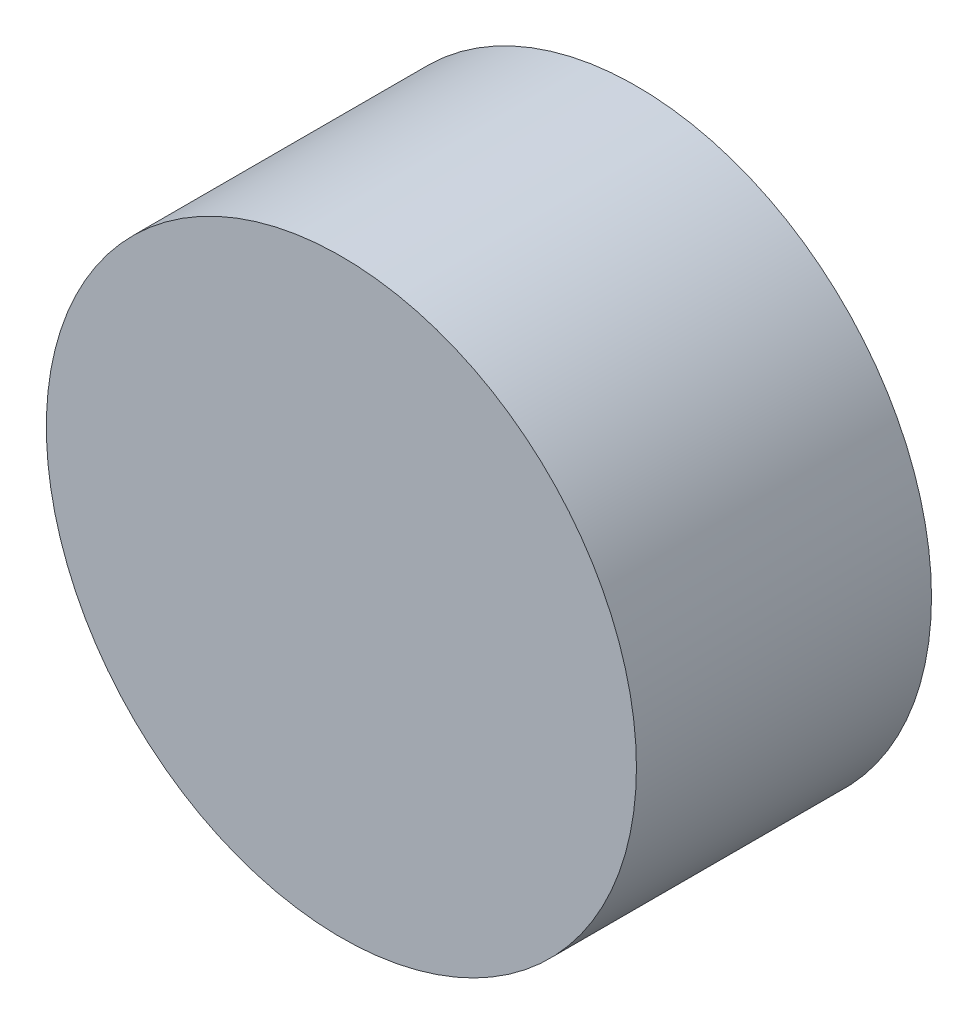
ISO-10303-21;
HEADER;
FILE_DESCRIPTION(('STEP AP214'),'2;1');
FILE_NAME('part.step','',(''),(''),'','','');
FILE_SCHEMA(('AUTOMOTIVE_DESIGN { 1 0 10303 214 1 1 1 1 }'));
ENDSEC;
DATA;
#1=APPLICATION_CONTEXT('core data for automotive mechanical design processes');
#2=APPLICATION_PROTOCOL_DEFINITION('international standard','automotive_design',2000,#1);
#3=PRODUCT_CONTEXT('',#1,'mechanical');
#4=PRODUCT('Part','Part','',(#3));
#5=PRODUCT_RELATED_PRODUCT_CATEGORY('part','',(#4));
#6=PRODUCT_DEFINITION_FORMATION('','',#4);
#7=PRODUCT_DEFINITION_CONTEXT('part definition',#1,'design');
#8=PRODUCT_DEFINITION('design','',#6,#7);
#9=PRODUCT_DEFINITION_SHAPE('','',#8);
#10=(LENGTH_UNIT() NAMED_UNIT(*) SI_UNIT(.MILLI.,.METRE.));
#11=(NAMED_UNIT(*) PLANE_ANGLE_UNIT() SI_UNIT($,.RADIAN.));
#12=(NAMED_UNIT(*) SI_UNIT($,.STERADIAN.) SOLID_ANGLE_UNIT());
#13=UNCERTAINTY_MEASURE_WITH_UNIT(LENGTH_MEASURE(1.E-05),#10,'distance_accuracy_value','');
#14=(GEOMETRIC_REPRESENTATION_CONTEXT(3) GLOBAL_UNCERTAINTY_ASSIGNED_CONTEXT((#13)) GLOBAL_UNIT_ASSIGNED_CONTEXT((#10,
#11,#12)) REPRESENTATION_CONTEXT('',''));
#15=CARTESIAN_POINT('',(0.,0.,0.));
#16=DIRECTION('',(0.,0.,1.));
#17=DIRECTION('',(1.,0.,0.));
#18=AXIS2_PLACEMENT_3D('',#15,#16,#17);
#19=CARTESIAN_POINT('',(0.,0.,1.));
#20=DIRECTION('',(0.,0.,-1.));
#21=DIRECTION('',(-1.,0.,0.));
#22=AXIS2_PLACEMENT_3D('',#19,#20,#21);
#23=CYLINDRICAL_SURFACE('',#22,2.);
#24=CARTESIAN_POINT('',(0.,0.,1.));
#25=DIRECTION('',(0.,0.,1.));
#26=DIRECTION('',(1.,0.,0.));
#27=AXIS2_PLACEMENT_3D('',#24,#25,#26);
#28=CIRCLE('',#27,2.);
#29=CARTESIAN_POINT('',(2.,0.,1.));
#30=VERTEX_POINT('',#29);
#31=EDGE_CURVE('E10',#30,#30,#28,.T.);
#32=ORIENTED_EDGE('',*,*,#31,.F.);
#33=EDGE_LOOP('',(#32));
#34=FACE_BOUND('',#33,.T.);
#35=CARTESIAN_POINT('',(0.,0.,-1.));
#36=DIRECTION('',(0.,0.,1.));
#37=DIRECTION('',(1.,0.,0.));
#38=AXIS2_PLACEMENT_3D('',#35,#36,#37);
#39=CIRCLE('',#38,2.);
#40=CARTESIAN_POINT('',(2.,0.,-1.));
#41=VERTEX_POINT('',#40);
#42=EDGE_CURVE('E40',#41,#41,#39,.T.);
#43=ORIENTED_EDGE('',*,*,#42,.T.);
#44=EDGE_LOOP('',(#43));
#45=FACE_BOUND('',#44,.T.);
#46=ADVANCED_FACE('F37',(#34,#45),#23,.T.);
#47=CARTESIAN_POINT('',(0.,0.,1.));
#48=DIRECTION('',(0.,0.,1.));
#49=DIRECTION('',(1.,0.,0.));
#50=AXIS2_PLACEMENT_3D('',#47,#48,#49);
#51=PLANE('',#50);
#52=ORIENTED_EDGE('',*,*,#31,.T.);
#53=EDGE_LOOP('',(#52));
#54=FACE_BOUND('',#53,.T.);
#55=ADVANCED_FACE('F54',(#54),#51,.T.);
#56=CARTESIAN_POINT('',(0.,0.,-1.));
#57=DIRECTION('',(0.,0.,1.));
#58=DIRECTION('',(1.,0.,0.));
#59=AXIS2_PLACEMENT_3D('',#56,#57,#58);
#60=PLANE('',#59);
#61=ORIENTED_EDGE('',*,*,#42,.F.);
#62=EDGE_LOOP('',(#61));
#63=FACE_BOUND('',#62,.T.);
#64=ADVANCED_FACE('F52',(#63),#60,.F.);
#65=CLOSED_SHELL('',(#46,#55,#64));
#66=MANIFOLD_SOLID_BREP('B2',#65);
#67=ADVANCED_BREP_SHAPE_REPRESENTATION('',(#18,#66),#14);
#68=SHAPE_DEFINITION_REPRESENTATION(#9,#67);
ENDSEC;
END-ISO-10303-21;
